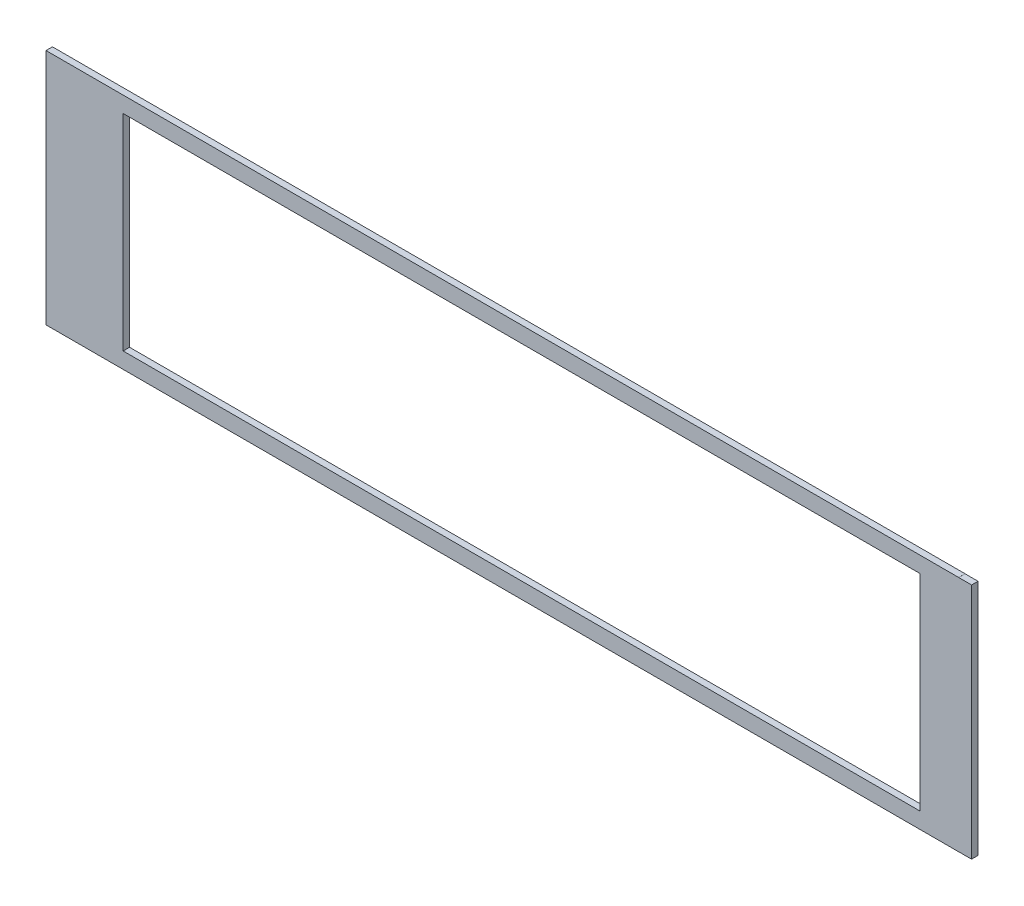
ISO-10303-21;
HEADER;
FILE_DESCRIPTION(('STEP AP214'),'2;1');
FILE_NAME('part.step','',(''),(''),'','','');
FILE_SCHEMA(('AUTOMOTIVE_DESIGN { 1 0 10303 214 1 1 1 1 }'));
ENDSEC;
DATA;
#1=APPLICATION_CONTEXT('core data for automotive mechanical design processes');
#2=APPLICATION_PROTOCOL_DEFINITION('international standard','automotive_design',2000,#1);
#3=PRODUCT_CONTEXT('',#1,'mechanical');
#4=PRODUCT('Part','Part','',(#3));
#5=PRODUCT_RELATED_PRODUCT_CATEGORY('part','',(#4));
#6=PRODUCT_DEFINITION_FORMATION('','',#4);
#7=PRODUCT_DEFINITION_CONTEXT('part definition',#1,'design');
#8=PRODUCT_DEFINITION('design','',#6,#7);
#9=PRODUCT_DEFINITION_SHAPE('','',#8);
#10=(LENGTH_UNIT() NAMED_UNIT(*) SI_UNIT(.MILLI.,.METRE.));
#11=(NAMED_UNIT(*) PLANE_ANGLE_UNIT() SI_UNIT($,.RADIAN.));
#12=(NAMED_UNIT(*) SI_UNIT($,.STERADIAN.) SOLID_ANGLE_UNIT());
#13=UNCERTAINTY_MEASURE_WITH_UNIT(LENGTH_MEASURE(1.E-05),#10,'distance_accuracy_value','');
#14=(GEOMETRIC_REPRESENTATION_CONTEXT(3) GLOBAL_UNCERTAINTY_ASSIGNED_CONTEXT((#13)) GLOBAL_UNIT_ASSIGNED_CONTEXT((#10,
#11,#12)) REPRESENTATION_CONTEXT('',''));
#15=CARTESIAN_POINT('',(0.,0.,0.));
#16=DIRECTION('',(0.,0.,1.));
#17=DIRECTION('',(1.,0.,0.));
#18=AXIS2_PLACEMENT_3D('',#15,#16,#17);
#19=CARTESIAN_POINT('',(0.,117.36705,3.175));
#20=DIRECTION('',(0.,1.,0.));
#21=DIRECTION('',(0.,0.,1.));
#22=AXIS2_PLACEMENT_3D('',#19,#20,#21);
#23=PLANE('',#22);
#24=DIRECTION('',(1.,0.,0.));
#25=VECTOR('',#24,1.);
#26=CARTESIAN_POINT('',(0.,117.36705,0.));
#27=LINE('',#26,#25);
#28=CARTESIAN_POINT('',(0.,117.36705,0.));
#29=VERTEX_POINT('',#28);
#30=CARTESIAN_POINT('',(450.85,117.36705,0.));
#31=VERTEX_POINT('',#30);
#32=EDGE_CURVE('E185',#29,#31,#27,.T.);
#33=ORIENTED_EDGE('',*,*,#32,.F.);
#34=DIRECTION('',(0.,0.,-1.));
#35=VECTOR('',#34,1.);
#36=CARTESIAN_POINT('',(0.,117.36705,3.175));
#37=LINE('',#36,#35);
#38=CARTESIAN_POINT('',(0.,117.36705,3.175));
#39=VERTEX_POINT('',#38);
#40=EDGE_CURVE('E11',#39,#29,#37,.T.);
#41=ORIENTED_EDGE('',*,*,#40,.F.);
#42=DIRECTION('',(1.,0.,0.));
#43=VECTOR('',#42,1.);
#44=CARTESIAN_POINT('',(0.,117.36705,3.175));
#45=LINE('',#44,#43);
#46=CARTESIAN_POINT('',(450.85,117.36705,3.175));
#47=VERTEX_POINT('',#46);
#48=EDGE_CURVE('E309',#39,#47,#45,.T.);
#49=ORIENTED_EDGE('',*,*,#48,.T.);
#50=DIRECTION('',(0.,0.,-1.));
#51=VECTOR('',#50,1.);
#52=CARTESIAN_POINT('',(450.85,117.36705,3.175));
#53=LINE('',#52,#51);
#54=EDGE_CURVE('E61',#47,#31,#53,.T.);
#55=ORIENTED_EDGE('',*,*,#54,.T.);
#56=EDGE_LOOP('',(#33,#41,#49,#55));
#57=FACE_BOUND('',#56,.T.);
#58=ADVANCED_FACE('F41',(#57),#23,.T.);
#59=CARTESIAN_POINT('',(0.,0.,3.175));
#60=DIRECTION('',(-1.,0.,0.));
#61=DIRECTION('',(0.,0.,1.));
#62=AXIS2_PLACEMENT_3D('',#59,#60,#61);
#63=PLANE('',#62);
#64=DIRECTION('',(0.,1.,0.));
#65=VECTOR('',#64,1.);
#66=CARTESIAN_POINT('',(0.,0.,0.));
#67=LINE('',#66,#65);
#68=CARTESIAN_POINT('',(0.,0.,0.));
#69=VERTEX_POINT('',#68);
#70=EDGE_CURVE('E188',#69,#29,#67,.T.);
#71=ORIENTED_EDGE('',*,*,#70,.F.);
#72=DIRECTION('',(0.,0.,-1.));
#73=VECTOR('',#72,1.);
#74=CARTESIAN_POINT('',(0.,0.,3.175));
#75=LINE('',#74,#73);
#76=CARTESIAN_POINT('',(0.,0.,3.175));
#77=VERTEX_POINT('',#76);
#78=EDGE_CURVE('E52',#77,#69,#75,.T.);
#79=ORIENTED_EDGE('',*,*,#78,.F.);
#80=DIRECTION('',(0.,1.,0.));
#81=VECTOR('',#80,1.);
#82=CARTESIAN_POINT('',(0.,0.,3.175));
#83=LINE('',#82,#81);
#84=EDGE_CURVE('E312',#77,#39,#83,.T.);
#85=ORIENTED_EDGE('',*,*,#84,.T.);
#86=ORIENTED_EDGE('',*,*,#40,.T.);
#87=EDGE_LOOP('',(#71,#79,#85,#86));
#88=FACE_BOUND('',#87,.T.);
#89=ADVANCED_FACE('F267',(#88),#63,.T.);
#90=CARTESIAN_POINT('',(0.,0.,3.175));
#91=DIRECTION('',(0.,1.,0.));
#92=DIRECTION('',(0.,0.,1.));
#93=AXIS2_PLACEMENT_3D('',#90,#91,#92);
#94=PLANE('',#93);
#95=DIRECTION('',(1.,0.,0.));
#96=VECTOR('',#95,1.);
#97=CARTESIAN_POINT('',(0.,0.,0.));
#98=LINE('',#97,#96);
#99=CARTESIAN_POINT('',(450.85,0.,0.));
#100=VERTEX_POINT('',#99);
#101=EDGE_CURVE('E192',#69,#100,#98,.T.);
#102=ORIENTED_EDGE('',*,*,#101,.T.);
#103=DIRECTION('',(0.,0.,-1.));
#104=VECTOR('',#103,1.);
#105=CARTESIAN_POINT('',(450.85,0.,3.175));
#106=LINE('',#105,#104);
#107=CARTESIAN_POINT('',(450.85,0.,3.175));
#108=VERTEX_POINT('',#107);
#109=EDGE_CURVE('E224',#108,#100,#106,.T.);
#110=ORIENTED_EDGE('',*,*,#109,.F.);
#111=DIRECTION('',(1.,0.,0.));
#112=VECTOR('',#111,1.);
#113=CARTESIAN_POINT('',(0.,0.,3.175));
#114=LINE('',#113,#112);
#115=EDGE_CURVE('E316',#77,#108,#114,.T.);
#116=ORIENTED_EDGE('',*,*,#115,.F.);
#117=ORIENTED_EDGE('',*,*,#78,.T.);
#118=EDGE_LOOP('',(#102,#110,#116,#117));
#119=FACE_BOUND('',#118,.T.);
#120=ADVANCED_FACE('F272',(#119),#94,.F.);
#121=CARTESIAN_POINT('',(450.85,0.,3.175));
#122=DIRECTION('',(-1.,0.,0.));
#123=DIRECTION('',(0.,0.,1.));
#124=AXIS2_PLACEMENT_3D('',#121,#122,#123);
#125=PLANE('',#124);
#126=DIRECTION('',(0.,1.,0.));
#127=VECTOR('',#126,1.);
#128=CARTESIAN_POINT('',(450.85,0.,0.));
#129=LINE('',#128,#127);
#130=CARTESIAN_POINT('',(450.85,0.0254000000000226,0.));
#131=VERTEX_POINT('',#130);
#132=EDGE_CURVE('E196',#100,#131,#129,.T.);
#133=ORIENTED_EDGE('',*,*,#132,.T.);
#134=DIRECTION('',(0.,0.,-1.));
#135=VECTOR('',#134,1.);
#136=CARTESIAN_POINT('',(450.85,0.0254000000000226,3.175));
#137=LINE('',#136,#135);
#138=CARTESIAN_POINT('',(450.85,0.0254000000000226,3.175));
#139=VERTEX_POINT('',#138);
#140=EDGE_CURVE('E220',#139,#131,#137,.T.);
#141=ORIENTED_EDGE('',*,*,#140,.F.);
#142=DIRECTION('',(0.,1.,0.));
#143=VECTOR('',#142,1.);
#144=CARTESIAN_POINT('',(450.85,0.,3.175));
#145=LINE('',#144,#143);
#146=EDGE_CURVE('E320',#108,#139,#145,.T.);
#147=ORIENTED_EDGE('',*,*,#146,.F.);
#148=ORIENTED_EDGE('',*,*,#109,.T.);
#149=EDGE_LOOP('',(#133,#141,#147,#148));
#150=FACE_BOUND('',#149,.T.);
#151=ADVANCED_FACE('F278',(#150),#125,.F.);
#152=CARTESIAN_POINT('',(0.,0.0254000000000226,3.175));
#153=DIRECTION('',(0.,1.,0.));
#154=DIRECTION('',(0.,0.,1.));
#155=AXIS2_PLACEMENT_3D('',#152,#153,#154);
#156=PLANE('',#155);
#157=DIRECTION('',(1.,0.,0.));
#158=VECTOR('',#157,1.);
#159=CARTESIAN_POINT('',(0.,0.0254000000000226,0.));
#160=LINE('',#159,#158);
#161=CARTESIAN_POINT('',(457.2,0.0254000000000226,0.));
#162=VERTEX_POINT('',#161);
#163=EDGE_CURVE('E200',#131,#162,#160,.T.);
#164=ORIENTED_EDGE('',*,*,#163,.T.);
#165=DIRECTION('',(0.,0.,-1.));
#166=VECTOR('',#165,1.);
#167=CARTESIAN_POINT('',(457.2,0.0254000000000226,3.175));
#168=LINE('',#167,#166);
#169=CARTESIAN_POINT('',(457.2,0.0254000000000226,3.175));
#170=VERTEX_POINT('',#169);
#171=EDGE_CURVE('E159',#170,#162,#168,.T.);
#172=ORIENTED_EDGE('',*,*,#171,.F.);
#173=DIRECTION('',(1.,0.,0.));
#174=VECTOR('',#173,1.);
#175=CARTESIAN_POINT('',(0.,0.0254000000000226,3.175));
#176=LINE('',#175,#174);
#177=EDGE_CURVE('E146',#139,#170,#176,.T.);
#178=ORIENTED_EDGE('',*,*,#177,.F.);
#179=ORIENTED_EDGE('',*,*,#140,.T.);
#180=EDGE_LOOP('',(#164,#172,#178,#179));
#181=FACE_BOUND('',#180,.T.);
#182=ADVANCED_FACE('F282',(#181),#156,.F.);
#183=CARTESIAN_POINT('',(457.2,0.,3.175));
#184=DIRECTION('',(-1.,0.,0.));
#185=DIRECTION('',(0.,0.,1.));
#186=AXIS2_PLACEMENT_3D('',#183,#184,#185);
#187=PLANE('',#186);
#188=DIRECTION('',(0.,1.,0.));
#189=VECTOR('',#188,1.);
#190=CARTESIAN_POINT('',(457.2,0.,0.));
#191=LINE('',#190,#189);
#192=CARTESIAN_POINT('',(457.2,117.34165,0.));
#193=VERTEX_POINT('',#192);
#194=EDGE_CURVE('E155',#162,#193,#191,.T.);
#195=ORIENTED_EDGE('',*,*,#194,.T.);
#196=DIRECTION('',(0.,0.,-1.));
#197=VECTOR('',#196,1.);
#198=CARTESIAN_POINT('',(457.2,117.34165,3.175));
#199=LINE('',#198,#197);
#200=CARTESIAN_POINT('',(457.2,117.34165,3.175));
#201=VERTEX_POINT('',#200);
#202=EDGE_CURVE('E153',#201,#193,#199,.T.);
#203=ORIENTED_EDGE('',*,*,#202,.F.);
#204=DIRECTION('',(0.,1.,0.));
#205=VECTOR('',#204,1.);
#206=CARTESIAN_POINT('',(457.2,0.,3.175));
#207=LINE('',#206,#205);
#208=EDGE_CURVE('E138',#170,#201,#207,.T.);
#209=ORIENTED_EDGE('',*,*,#208,.F.);
#210=ORIENTED_EDGE('',*,*,#171,.T.);
#211=EDGE_LOOP('',(#195,#203,#209,#210));
#212=FACE_BOUND('',#211,.T.);
#213=ADVANCED_FACE('F154',(#212),#187,.F.);
#214=CARTESIAN_POINT('',(0.,117.34165,3.175));
#215=DIRECTION('',(0.,1.,0.));
#216=DIRECTION('',(0.,0.,1.));
#217=AXIS2_PLACEMENT_3D('',#214,#215,#216);
#218=PLANE('',#217);
#219=DIRECTION('',(1.,0.,0.));
#220=VECTOR('',#219,1.);
#221=CARTESIAN_POINT('',(0.,117.34165,0.));
#222=LINE('',#221,#220);
#223=CARTESIAN_POINT('',(450.85,117.34165,0.));
#224=VERTEX_POINT('',#223);
#225=EDGE_CURVE('E206',#224,#193,#222,.T.);
#226=ORIENTED_EDGE('',*,*,#225,.F.);
#227=DIRECTION('',(0.,0.,-1.));
#228=VECTOR('',#227,1.);
#229=CARTESIAN_POINT('',(450.85,117.34165,3.175));
#230=LINE('',#229,#228);
#231=CARTESIAN_POINT('',(450.85,117.34165,3.175));
#232=VERTEX_POINT('',#231);
#233=EDGE_CURVE('E98',#232,#224,#230,.T.);
#234=ORIENTED_EDGE('',*,*,#233,.F.);
#235=DIRECTION('',(1.,0.,0.));
#236=VECTOR('',#235,1.);
#237=CARTESIAN_POINT('',(0.,117.34165,3.175));
#238=LINE('',#237,#236);
#239=EDGE_CURVE('E144',#232,#201,#238,.T.);
#240=ORIENTED_EDGE('',*,*,#239,.T.);
#241=ORIENTED_EDGE('',*,*,#202,.T.);
#242=EDGE_LOOP('',(#226,#234,#240,#241));
#243=FACE_BOUND('',#242,.T.);
#244=ADVANCED_FACE('F161',(#243),#218,.T.);
#245=CARTESIAN_POINT('',(38.1000000000001,0.,3.175));
#246=DIRECTION('',(1.,0.,0.));
#247=DIRECTION('',(0.,0.,-1.));
#248=AXIS2_PLACEMENT_3D('',#245,#246,#247);
#249=PLANE('',#248);
#250=DIRECTION('',(0.,-1.,0.));
#251=VECTOR('',#250,1.);
#252=CARTESIAN_POINT('',(38.1000000000001,0.,0.));
#253=LINE('',#252,#251);
#254=CARTESIAN_POINT('',(38.1000000000001,109.483525,0.));
#255=VERTEX_POINT('',#254);
#256=CARTESIAN_POINT('',(38.1000000000001,7.883525,0.));
#257=VERTEX_POINT('',#256);
#258=EDGE_CURVE('E170',#255,#257,#253,.T.);
#259=ORIENTED_EDGE('',*,*,#258,.F.);
#260=DIRECTION('',(0.,0.,-1.));
#261=VECTOR('',#260,1.);
#262=CARTESIAN_POINT('',(38.1000000000001,109.483525,3.175));
#263=LINE('',#262,#261);
#264=CARTESIAN_POINT('',(38.1000000000001,109.483525,3.175));
#265=VERTEX_POINT('',#264);
#266=EDGE_CURVE('E45',#265,#255,#263,.T.);
#267=ORIENTED_EDGE('',*,*,#266,.F.);
#268=DIRECTION('',(0.,-1.,0.));
#269=VECTOR('',#268,1.);
#270=CARTESIAN_POINT('',(38.1000000000001,0.,3.175));
#271=LINE('',#270,#269);
#272=CARTESIAN_POINT('',(38.1000000000001,7.883525,3.175));
#273=VERTEX_POINT('',#272);
#274=EDGE_CURVE('E213',#265,#273,#271,.T.);
#275=ORIENTED_EDGE('',*,*,#274,.T.);
#276=DIRECTION('',(0.,0.,-1.));
#277=VECTOR('',#276,1.);
#278=CARTESIAN_POINT('',(38.1000000000001,7.883525,3.175));
#279=LINE('',#278,#277);
#280=EDGE_CURVE('E166',#273,#257,#279,.T.);
#281=ORIENTED_EDGE('',*,*,#280,.T.);
#282=EDGE_LOOP('',(#259,#267,#275,#281));
#283=FACE_BOUND('',#282,.T.);
#284=ADVANCED_FACE('F43',(#283),#249,.T.);
#285=CARTESIAN_POINT('',(0.,109.483525,3.175));
#286=DIRECTION('',(0.,1.,0.));
#287=DIRECTION('',(0.,0.,1.));
#288=AXIS2_PLACEMENT_3D('',#285,#286,#287);
#289=PLANE('',#288);
#290=DIRECTION('',(1.,0.,0.));
#291=VECTOR('',#290,1.);
#292=CARTESIAN_POINT('',(0.,109.483525,0.));
#293=LINE('',#292,#291);
#294=CARTESIAN_POINT('',(431.8,109.483525,0.));
#295=VERTEX_POINT('',#294);
#296=EDGE_CURVE('E174',#255,#295,#293,.T.);
#297=ORIENTED_EDGE('',*,*,#296,.T.);
#298=DIRECTION('',(0.,0.,-1.));
#299=VECTOR('',#298,1.);
#300=CARTESIAN_POINT('',(431.8,109.483525,3.175));
#301=LINE('',#300,#299);
#302=CARTESIAN_POINT('',(431.8,109.483525,3.175));
#303=VERTEX_POINT('',#302);
#304=EDGE_CURVE('E234',#303,#295,#301,.T.);
#305=ORIENTED_EDGE('',*,*,#304,.F.);
#306=DIRECTION('',(1.,0.,0.));
#307=VECTOR('',#306,1.);
#308=CARTESIAN_POINT('',(0.,109.483525,3.175));
#309=LINE('',#308,#307);
#310=EDGE_CURVE('E245',#265,#303,#309,.T.);
#311=ORIENTED_EDGE('',*,*,#310,.F.);
#312=ORIENTED_EDGE('',*,*,#266,.T.);
#313=EDGE_LOOP('',(#297,#305,#311,#312));
#314=FACE_BOUND('',#313,.T.);
#315=ADVANCED_FACE('F244',(#314),#289,.F.);
#316=CARTESIAN_POINT('',(431.8,0.,3.175));
#317=DIRECTION('',(1.,0.,0.));
#318=DIRECTION('',(0.,0.,-1.));
#319=AXIS2_PLACEMENT_3D('',#316,#317,#318);
#320=PLANE('',#319);
#321=DIRECTION('',(0.,-1.,0.));
#322=VECTOR('',#321,1.);
#323=CARTESIAN_POINT('',(431.8,0.,0.));
#324=LINE('',#323,#322);
#325=CARTESIAN_POINT('',(431.8,7.883525,0.));
#326=VERTEX_POINT('',#325);
#327=EDGE_CURVE('E177',#295,#326,#324,.T.);
#328=ORIENTED_EDGE('',*,*,#327,.T.);
#329=DIRECTION('',(0.,0.,-1.));
#330=VECTOR('',#329,1.);
#331=CARTESIAN_POINT('',(431.8,7.883525,3.175));
#332=LINE('',#331,#330);
#333=CARTESIAN_POINT('',(431.8,7.883525,3.175));
#334=VERTEX_POINT('',#333);
#335=EDGE_CURVE('E232',#334,#326,#332,.T.);
#336=ORIENTED_EDGE('',*,*,#335,.F.);
#337=DIRECTION('',(0.,-1.,0.));
#338=VECTOR('',#337,1.);
#339=CARTESIAN_POINT('',(431.8,0.,3.175));
#340=LINE('',#339,#338);
#341=EDGE_CURVE('E302',#303,#334,#340,.T.);
#342=ORIENTED_EDGE('',*,*,#341,.F.);
#343=ORIENTED_EDGE('',*,*,#304,.T.);
#344=EDGE_LOOP('',(#328,#336,#342,#343));
#345=FACE_BOUND('',#344,.T.);
#346=ADVANCED_FACE('F257',(#345),#320,.F.);
#347=CARTESIAN_POINT('',(0.,7.883525,3.175));
#348=DIRECTION('',(0.,1.,0.));
#349=DIRECTION('',(0.,0.,1.));
#350=AXIS2_PLACEMENT_3D('',#347,#348,#349);
#351=PLANE('',#350);
#352=DIRECTION('',(1.,0.,0.));
#353=VECTOR('',#352,1.);
#354=CARTESIAN_POINT('',(0.,7.883525,0.));
#355=LINE('',#354,#353);
#356=EDGE_CURVE('E181',#257,#326,#355,.T.);
#357=ORIENTED_EDGE('',*,*,#356,.F.);
#358=ORIENTED_EDGE('',*,*,#280,.F.);
#359=DIRECTION('',(1.,0.,0.));
#360=VECTOR('',#359,1.);
#361=CARTESIAN_POINT('',(0.,7.883525,3.175));
#362=LINE('',#361,#360);
#363=EDGE_CURVE('E255',#273,#334,#362,.T.);
#364=ORIENTED_EDGE('',*,*,#363,.T.);
#365=ORIENTED_EDGE('',*,*,#335,.T.);
#366=EDGE_LOOP('',(#357,#358,#364,#365));
#367=FACE_BOUND('',#366,.T.);
#368=ADVANCED_FACE('F254',(#367),#351,.T.);
#369=CARTESIAN_POINT('',(450.85,0.,3.175));
#370=DIRECTION('',(1.,0.,0.));
#371=DIRECTION('',(0.,0.,-1.));
#372=AXIS2_PLACEMENT_3D('',#369,#370,#371);
#373=PLANE('',#372);
#374=DIRECTION('',(0.,-1.,0.));
#375=VECTOR('',#374,1.);
#376=CARTESIAN_POINT('',(450.85,0.,0.));
#377=LINE('',#376,#375);
#378=EDGE_CURVE('E209',#31,#224,#377,.T.);
#379=ORIENTED_EDGE('',*,*,#378,.F.);
#380=ORIENTED_EDGE('',*,*,#54,.F.);
#381=DIRECTION('',(0.,-1.,0.));
#382=VECTOR('',#381,1.);
#383=CARTESIAN_POINT('',(450.85,0.,3.175));
#384=LINE('',#383,#382);
#385=EDGE_CURVE('E163',#47,#232,#384,.T.);
#386=ORIENTED_EDGE('',*,*,#385,.T.);
#387=ORIENTED_EDGE('',*,*,#233,.T.);
#388=EDGE_LOOP('',(#379,#380,#386,#387));
#389=FACE_BOUND('',#388,.T.);
#390=ADVANCED_FACE('F264',(#389),#373,.T.);
#391=CARTESIAN_POINT('',(0.,0.,3.175));
#392=DIRECTION('',(0.,0.,1.));
#393=DIRECTION('',(1.,0.,0.));
#394=AXIS2_PLACEMENT_3D('',#391,#392,#393);
#395=PLANE('',#394);
#396=ORIENTED_EDGE('',*,*,#274,.F.);
#397=ORIENTED_EDGE('',*,*,#310,.T.);
#398=ORIENTED_EDGE('',*,*,#341,.T.);
#399=ORIENTED_EDGE('',*,*,#363,.F.);
#400=EDGE_LOOP('',(#396,#397,#398,#399));
#401=FACE_BOUND('',#400,.T.);
#402=ORIENTED_EDGE('',*,*,#48,.F.);
#403=ORIENTED_EDGE('',*,*,#84,.F.);
#404=ORIENTED_EDGE('',*,*,#115,.T.);
#405=ORIENTED_EDGE('',*,*,#146,.T.);
#406=ORIENTED_EDGE('',*,*,#177,.T.);
#407=ORIENTED_EDGE('',*,*,#208,.T.);
#408=ORIENTED_EDGE('',*,*,#239,.F.);
#409=ORIENTED_EDGE('',*,*,#385,.F.);
#410=EDGE_LOOP('',(#402,#403,#404,#405,#406,#407,#408,#409));
#411=FACE_BOUND('',#410,.T.);
#412=ADVANCED_FACE('F141',(#401,#411),#395,.T.);
#413=CARTESIAN_POINT('',(0.,0.,0.));
#414=DIRECTION('',(0.,0.,1.));
#415=DIRECTION('',(1.,0.,0.));
#416=AXIS2_PLACEMENT_3D('',#413,#414,#415);
#417=PLANE('',#416);
#418=ORIENTED_EDGE('',*,*,#258,.T.);
#419=ORIENTED_EDGE('',*,*,#356,.T.);
#420=ORIENTED_EDGE('',*,*,#327,.F.);
#421=ORIENTED_EDGE('',*,*,#296,.F.);
#422=EDGE_LOOP('',(#418,#419,#420,#421));
#423=FACE_BOUND('',#422,.T.);
#424=ORIENTED_EDGE('',*,*,#32,.T.);
#425=ORIENTED_EDGE('',*,*,#378,.T.);
#426=ORIENTED_EDGE('',*,*,#225,.T.);
#427=ORIENTED_EDGE('',*,*,#194,.F.);
#428=ORIENTED_EDGE('',*,*,#163,.F.);
#429=ORIENTED_EDGE('',*,*,#132,.F.);
#430=ORIENTED_EDGE('',*,*,#101,.F.);
#431=ORIENTED_EDGE('',*,*,#70,.T.);
#432=EDGE_LOOP('',(#424,#425,#426,#427,#428,#429,#430,#431));
#433=FACE_BOUND('',#432,.T.);
#434=ADVANCED_FACE('F248',(#423,#433),#417,.F.);
#435=CLOSED_SHELL('',(#58,#89,#120,#151,#182,#213,#244,#284,#315,#346,#368,#390,#412,#434));
#436=MANIFOLD_SOLID_BREP('B2',#435);
#437=ADVANCED_BREP_SHAPE_REPRESENTATION('',(#18,#436),#14);
#438=SHAPE_DEFINITION_REPRESENTATION(#9,#437);
ENDSEC;
END-ISO-10303-21;
